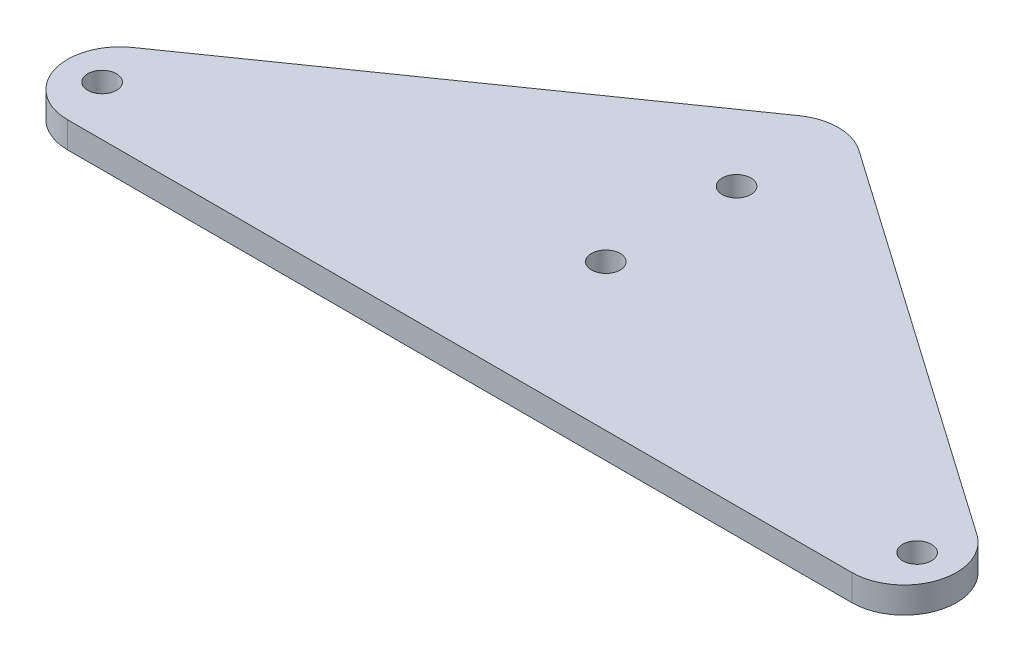
ISO-10303-21;
HEADER;
FILE_DESCRIPTION(('STEP AP214'),'2;1');
FILE_NAME('part.step','',(''),(''),'','','');
FILE_SCHEMA(('AUTOMOTIVE_DESIGN { 1 0 10303 214 1 1 1 1 }'));
ENDSEC;
DATA;
#1=APPLICATION_CONTEXT('core data for automotive mechanical design processes');
#2=APPLICATION_PROTOCOL_DEFINITION('international standard','automotive_design',2000,#1);
#3=PRODUCT_CONTEXT('',#1,'mechanical');
#4=PRODUCT('Part','Part','',(#3));
#5=PRODUCT_RELATED_PRODUCT_CATEGORY('part','',(#4));
#6=PRODUCT_DEFINITION_FORMATION('','',#4);
#7=PRODUCT_DEFINITION_CONTEXT('part definition',#1,'design');
#8=PRODUCT_DEFINITION('design','',#6,#7);
#9=PRODUCT_DEFINITION_SHAPE('','',#8);
#10=(LENGTH_UNIT() NAMED_UNIT(*) SI_UNIT(.MILLI.,.METRE.));
#11=(NAMED_UNIT(*) PLANE_ANGLE_UNIT() SI_UNIT($,.RADIAN.));
#12=(NAMED_UNIT(*) SI_UNIT($,.STERADIAN.) SOLID_ANGLE_UNIT());
#13=UNCERTAINTY_MEASURE_WITH_UNIT(LENGTH_MEASURE(1.E-05),#10,'distance_accuracy_value','');
#14=(GEOMETRIC_REPRESENTATION_CONTEXT(3) GLOBAL_UNCERTAINTY_ASSIGNED_CONTEXT((#13)) GLOBAL_UNIT_ASSIGNED_CONTEXT((#10,
#11,#12)) REPRESENTATION_CONTEXT('',''));
#15=CARTESIAN_POINT('',(0.,0.,0.));
#16=DIRECTION('',(0.,0.,1.));
#17=DIRECTION('',(1.,0.,0.));
#18=AXIS2_PLACEMENT_3D('',#15,#16,#17);
#19=CARTESIAN_POINT('',(75.,5.,-2.04927415816925));
#20=DIRECTION('',(0.,-1.,0.));
#21=DIRECTION('',(0.,0.,-1.));
#22=AXIS2_PLACEMENT_3D('',#19,#20,#21);
#23=CYLINDRICAL_SURFACE('',#22,10.);
#24=CARTESIAN_POINT('',(75.,0.,-2.04927415816925));
#25=DIRECTION('',(0.,1.,0.));
#26=DIRECTION('',(0.,0.,1.));
#27=AXIS2_PLACEMENT_3D('',#24,#25,#26);
#28=CIRCLE('',#27,10.);
#29=CARTESIAN_POINT('',(75.,0.,7.95072584183075));
#30=VERTEX_POINT('',#29);
#31=CARTESIAN_POINT('',(80.728613730277,0.,-10.2457968799874));
#32=VERTEX_POINT('',#31);
#33=EDGE_CURVE('E127',#30,#32,#28,.T.);
#34=ORIENTED_EDGE('',*,*,#33,.T.);
#35=DIRECTION('',(0.,-1.,0.));
#36=VECTOR('',#35,1.);
#37=CARTESIAN_POINT('',(80.728613730277,5.,-10.2457968799874));
#38=LINE('',#37,#36);
#39=CARTESIAN_POINT('',(80.728613730277,5.,-10.2457968799874));
#40=VERTEX_POINT('',#39);
#41=EDGE_CURVE('E11',#40,#32,#38,.T.);
#42=ORIENTED_EDGE('',*,*,#41,.F.);
#43=CARTESIAN_POINT('',(75.,5.,-2.04927415816925));
#44=DIRECTION('',(0.,1.,0.));
#45=DIRECTION('',(0.,0.,1.));
#46=AXIS2_PLACEMENT_3D('',#43,#44,#45);
#47=CIRCLE('',#46,10.);
#48=CARTESIAN_POINT('',(75.,5.,7.95072584183075));
#49=VERTEX_POINT('',#48);
#50=EDGE_CURVE('E138',#49,#40,#47,.T.);
#51=ORIENTED_EDGE('',*,*,#50,.F.);
#52=DIRECTION('',(0.,-1.,0.));
#53=VECTOR('',#52,1.);
#54=CARTESIAN_POINT('',(75.,5.,7.95072584183075));
#55=LINE('',#54,#53);
#56=EDGE_CURVE('E123',#49,#30,#55,.T.);
#57=ORIENTED_EDGE('',*,*,#56,.T.);
#58=EDGE_LOOP('',(#34,#42,#51,#57));
#59=FACE_BOUND('',#58,.T.);
#60=ADVANCED_FACE('F43',(#59),#23,.T.);
#61=CARTESIAN_POINT('',(80.728613730277,5.,-10.2457968799874));
#62=DIRECTION('',(-0.572861373027704,0.,0.819652272181816));
#63=DIRECTION('',(0.819652272181816,0.,0.572861373027704));
#64=AXIS2_PLACEMENT_3D('',#61,#62,#63);
#65=PLANE('',#64);
#66=DIRECTION('',(-0.819652272181816,0.,-0.572861373027704));
#67=VECTOR('',#66,1.);
#68=CARTESIAN_POINT('',(80.728613730277,0.,-10.2457968799874));
#69=LINE('',#68,#67);
#70=CARTESIAN_POINT('',(5.72861373027705,0.,-62.6638824941604));
#71=VERTEX_POINT('',#70);
#72=EDGE_CURVE('E130',#32,#71,#69,.T.);
#73=ORIENTED_EDGE('',*,*,#72,.T.);
#74=DIRECTION('',(0.,-1.,0.));
#75=VECTOR('',#74,1.);
#76=CARTESIAN_POINT('',(5.72861373027705,5.,-62.6638824941604));
#77=LINE('',#76,#75);
#78=CARTESIAN_POINT('',(5.72861373027705,5.,-62.6638824941604));
#79=VERTEX_POINT('',#78);
#80=EDGE_CURVE('E51',#79,#71,#77,.T.);
#81=ORIENTED_EDGE('',*,*,#80,.F.);
#82=DIRECTION('',(-0.819652272181816,0.,-0.572861373027704));
#83=VECTOR('',#82,1.);
#84=CARTESIAN_POINT('',(80.728613730277,5.,-10.2457968799874));
#85=LINE('',#84,#83);
#86=EDGE_CURVE('E96',#40,#79,#85,.T.);
#87=ORIENTED_EDGE('',*,*,#86,.F.);
#88=ORIENTED_EDGE('',*,*,#41,.T.);
#89=EDGE_LOOP('',(#73,#81,#87,#88));
#90=FACE_BOUND('',#89,.T.);
#91=ADVANCED_FACE('F163',(#90),#65,.F.);
#92=CARTESIAN_POINT('',(0.,5.,-54.4673597723422));
#93=DIRECTION('',(0.,-1.,0.));
#94=DIRECTION('',(0.,0.,-1.));
#95=AXIS2_PLACEMENT_3D('',#92,#93,#94);
#96=CYLINDRICAL_SURFACE('',#95,10.);
#97=CARTESIAN_POINT('',(0.,0.,-54.4673597723422));
#98=DIRECTION('',(0.,1.,0.));
#99=DIRECTION('',(0.,0.,-1.));
#100=AXIS2_PLACEMENT_3D('',#97,#98,#99);
#101=CIRCLE('',#100,10.);
#102=CARTESIAN_POINT('',(-5.72861373027705,0.,-62.6638824941604));
#103=VERTEX_POINT('',#102);
#104=EDGE_CURVE('E133',#71,#103,#101,.T.);
#105=ORIENTED_EDGE('',*,*,#104,.T.);
#106=DIRECTION('',(0.,-1.,0.));
#107=VECTOR('',#106,1.);
#108=CARTESIAN_POINT('',(-5.72861373027705,5.,-62.6638824941604));
#109=LINE('',#108,#107);
#110=CARTESIAN_POINT('',(-5.72861373027705,5.,-62.6638824941604));
#111=VERTEX_POINT('',#110);
#112=EDGE_CURVE('E118',#111,#103,#109,.T.);
#113=ORIENTED_EDGE('',*,*,#112,.F.);
#114=CARTESIAN_POINT('',(0.,5.,-54.4673597723422));
#115=DIRECTION('',(0.,1.,0.));
#116=DIRECTION('',(0.,0.,-1.));
#117=AXIS2_PLACEMENT_3D('',#114,#115,#116);
#118=CIRCLE('',#117,10.);
#119=EDGE_CURVE('E109',#79,#111,#118,.T.);
#120=ORIENTED_EDGE('',*,*,#119,.F.);
#121=ORIENTED_EDGE('',*,*,#80,.T.);
#122=EDGE_LOOP('',(#105,#113,#120,#121));
#123=FACE_BOUND('',#122,.T.);
#124=ADVANCED_FACE('F144',(#123),#96,.T.);
#125=CARTESIAN_POINT('',(-5.72861373027705,5.,-62.6638824941604));
#126=DIRECTION('',(0.572861373027704,0.,0.819652272181816));
#127=DIRECTION('',(0.819652272181816,0.,-0.572861373027704));
#128=AXIS2_PLACEMENT_3D('',#125,#126,#127);
#129=PLANE('',#128);
#130=DIRECTION('',(-0.819652272181816,0.,0.572861373027704));
#131=VECTOR('',#130,1.);
#132=CARTESIAN_POINT('',(-5.72861373027705,0.,-62.6638824941604));
#133=LINE('',#132,#131);
#134=CARTESIAN_POINT('',(-80.728613730277,0.,-10.2457968799874));
#135=VERTEX_POINT('',#134);
#136=EDGE_CURVE('E117',#103,#135,#133,.T.);
#137=ORIENTED_EDGE('',*,*,#136,.T.);
#138=DIRECTION('',(0.,-1.,0.));
#139=VECTOR('',#138,1.);
#140=CARTESIAN_POINT('',(-80.728613730277,5.,-10.2457968799874));
#141=LINE('',#140,#139);
#142=CARTESIAN_POINT('',(-80.728613730277,5.,-10.2457968799874));
#143=VERTEX_POINT('',#142);
#144=EDGE_CURVE('E114',#143,#135,#141,.T.);
#145=ORIENTED_EDGE('',*,*,#144,.F.);
#146=DIRECTION('',(-0.819652272181816,0.,0.572861373027704));
#147=VECTOR('',#146,1.);
#148=CARTESIAN_POINT('',(-5.72861373027705,5.,-62.6638824941604));
#149=LINE('',#148,#147);
#150=EDGE_CURVE('E103',#111,#143,#149,.T.);
#151=ORIENTED_EDGE('',*,*,#150,.F.);
#152=ORIENTED_EDGE('',*,*,#112,.T.);
#153=EDGE_LOOP('',(#137,#145,#151,#152));
#154=FACE_BOUND('',#153,.T.);
#155=ADVANCED_FACE('F115',(#154),#129,.F.);
#156=CARTESIAN_POINT('',(-75.,5.,-2.04927415816923));
#157=DIRECTION('',(0.,-1.,0.));
#158=DIRECTION('',(0.,0.,-1.));
#159=AXIS2_PLACEMENT_3D('',#156,#157,#158);
#160=CYLINDRICAL_SURFACE('',#159,10.);
#161=CARTESIAN_POINT('',(-75.,0.,-2.04927415816923));
#162=DIRECTION('',(0.,1.,0.));
#163=DIRECTION('',(0.,0.,1.));
#164=AXIS2_PLACEMENT_3D('',#161,#162,#163);
#165=CIRCLE('',#164,10.);
#166=CARTESIAN_POINT('',(-75.,0.,7.95072584183077));
#167=VERTEX_POINT('',#166);
#168=EDGE_CURVE('E82',#135,#167,#165,.T.);
#169=ORIENTED_EDGE('',*,*,#168,.T.);
#170=DIRECTION('',(0.,-1.,0.));
#171=VECTOR('',#170,1.);
#172=CARTESIAN_POINT('',(-75.,5.,7.95072584183077));
#173=LINE('',#172,#171);
#174=CARTESIAN_POINT('',(-75.,5.,7.95072584183077));
#175=VERTEX_POINT('',#174);
#176=EDGE_CURVE('E119',#175,#167,#173,.T.);
#177=ORIENTED_EDGE('',*,*,#176,.F.);
#178=CARTESIAN_POINT('',(-75.,5.,-2.04927415816923));
#179=DIRECTION('',(0.,1.,0.));
#180=DIRECTION('',(0.,0.,1.));
#181=AXIS2_PLACEMENT_3D('',#178,#179,#180);
#182=CIRCLE('',#181,10.);
#183=EDGE_CURVE('E107',#143,#175,#182,.T.);
#184=ORIENTED_EDGE('',*,*,#183,.F.);
#185=ORIENTED_EDGE('',*,*,#144,.T.);
#186=EDGE_LOOP('',(#169,#177,#184,#185));
#187=FACE_BOUND('',#186,.T.);
#188=ADVANCED_FACE('F121',(#187),#160,.T.);
#189=CARTESIAN_POINT('',(-75.,5.,7.95072584183077));
#190=DIRECTION('',(0.,0.,-1.));
#191=DIRECTION('',(-1.,0.,0.));
#192=AXIS2_PLACEMENT_3D('',#189,#190,#191);
#193=PLANE('',#192);
#194=DIRECTION('',(1.,0.,0.));
#195=VECTOR('',#194,1.);
#196=CARTESIAN_POINT('',(-75.,0.,7.95072584183077));
#197=LINE('',#196,#195);
#198=EDGE_CURVE('E88',#167,#30,#197,.T.);
#199=ORIENTED_EDGE('',*,*,#198,.T.);
#200=ORIENTED_EDGE('',*,*,#56,.F.);
#201=DIRECTION('',(1.,0.,0.));
#202=VECTOR('',#201,1.);
#203=CARTESIAN_POINT('',(-75.,5.,7.95072584183077));
#204=LINE('',#203,#202);
#205=EDGE_CURVE('E59',#175,#49,#204,.T.);
#206=ORIENTED_EDGE('',*,*,#205,.F.);
#207=ORIENTED_EDGE('',*,*,#176,.T.);
#208=EDGE_LOOP('',(#199,#200,#206,#207));
#209=FACE_BOUND('',#208,.T.);
#210=ADVANCED_FACE('F151',(#209),#193,.F.);
#211=CARTESIAN_POINT('',(75.,5.,-2.04927415816925));
#212=DIRECTION('',(0.,1.,0.));
#213=DIRECTION('',(0.,0.,1.));
#214=AXIS2_PLACEMENT_3D('',#211,#212,#213);
#215=PLANE('',#214);
#216=CARTESIAN_POINT('',(77.9289159969783,5.,-1.58750543105869));
#217=DIRECTION('',(0.,1.,0.));
#218=DIRECTION('',(0.,0.,1.));
#219=AXIS2_PLACEMENT_3D('',#216,#217,#218);
#220=CIRCLE('',#219,2.74999999999999);
#221=CARTESIAN_POINT('',(77.9289159969783,5.,1.1624945689413));
#222=VERTEX_POINT('',#221);
#223=EDGE_CURVE('E305',#222,#222,#220,.T.);
#224=ORIENTED_EDGE('',*,*,#223,.F.);
#225=EDGE_LOOP('',(#224));
#226=FACE_BOUND('',#225,.T.);
#227=CARTESIAN_POINT('',(-77.9289159969783,5.,-1.58750543105869));
#228=DIRECTION('',(0.,1.,0.));
#229=DIRECTION('',(0.,0.,1.));
#230=AXIS2_PLACEMENT_3D('',#227,#228,#229);
#231=CIRCLE('',#230,2.74999999999999);
#232=CARTESIAN_POINT('',(-77.9289159969783,5.,1.1624945689413));
#233=VERTEX_POINT('',#232);
#234=EDGE_CURVE('E307',#233,#233,#231,.T.);
#235=ORIENTED_EDGE('',*,*,#234,.F.);
#236=EDGE_LOOP('',(#235));
#237=FACE_BOUND('',#236,.T.);
#238=CARTESIAN_POINT('',(0.,5.,-45.));
#239=DIRECTION('',(0.,1.,0.));
#240=DIRECTION('',(0.,0.,1.));
#241=AXIS2_PLACEMENT_3D('',#238,#239,#240);
#242=CIRCLE('',#241,2.74999999999999);
#243=CARTESIAN_POINT('',(0.,5.,-42.25));
#244=VERTEX_POINT('',#243);
#245=EDGE_CURVE('E315',#244,#244,#242,.T.);
#246=ORIENTED_EDGE('',*,*,#245,.F.);
#247=EDGE_LOOP('',(#246));
#248=FACE_BOUND('',#247,.T.);
#249=CARTESIAN_POINT('',(0.,5.,-20.));
#250=DIRECTION('',(0.,1.,0.));
#251=DIRECTION('',(0.,0.,1.));
#252=AXIS2_PLACEMENT_3D('',#249,#250,#251);
#253=CIRCLE('',#252,2.74999999999999);
#254=CARTESIAN_POINT('',(0.,5.,-17.25));
#255=VERTEX_POINT('',#254);
#256=EDGE_CURVE('E321',#255,#255,#253,.T.);
#257=ORIENTED_EDGE('',*,*,#256,.F.);
#258=EDGE_LOOP('',(#257));
#259=FACE_BOUND('',#258,.T.);
#260=ORIENTED_EDGE('',*,*,#50,.T.);
#261=ORIENTED_EDGE('',*,*,#86,.T.);
#262=ORIENTED_EDGE('',*,*,#119,.T.);
#263=ORIENTED_EDGE('',*,*,#150,.T.);
#264=ORIENTED_EDGE('',*,*,#183,.T.);
#265=ORIENTED_EDGE('',*,*,#205,.T.);
#266=EDGE_LOOP('',(#260,#261,#262,#263,#264,#265));
#267=FACE_BOUND('',#266,.T.);
#268=ADVANCED_FACE('F105',(#226,#237,#248,#259,#267),#215,.T.);
#269=CARTESIAN_POINT('',(75.,0.,-2.04927415816925));
#270=DIRECTION('',(0.,1.,0.));
#271=DIRECTION('',(0.,0.,1.));
#272=AXIS2_PLACEMENT_3D('',#269,#270,#271);
#273=PLANE('',#272);
#274=CARTESIAN_POINT('',(77.9289159969783,0.,-1.58750543105869));
#275=DIRECTION('',(0.,1.,0.));
#276=DIRECTION('',(0.,0.,1.));
#277=AXIS2_PLACEMENT_3D('',#274,#275,#276);
#278=CIRCLE('',#277,2.75);
#279=CARTESIAN_POINT('',(77.9289159969783,0.,1.16249456894132));
#280=VERTEX_POINT('',#279);
#281=EDGE_CURVE('E302',#280,#280,#278,.T.);
#282=ORIENTED_EDGE('',*,*,#281,.T.);
#283=EDGE_LOOP('',(#282));
#284=FACE_BOUND('',#283,.T.);
#285=CARTESIAN_POINT('',(-77.9289159969783,0.,-1.58750543105869));
#286=DIRECTION('',(0.,1.,0.));
#287=DIRECTION('',(0.,0.,1.));
#288=AXIS2_PLACEMENT_3D('',#285,#286,#287);
#289=CIRCLE('',#288,2.75);
#290=CARTESIAN_POINT('',(-77.9289159969783,0.,1.16249456894132));
#291=VERTEX_POINT('',#290);
#292=EDGE_CURVE('E312',#291,#291,#289,.T.);
#293=ORIENTED_EDGE('',*,*,#292,.T.);
#294=EDGE_LOOP('',(#293));
#295=FACE_BOUND('',#294,.T.);
#296=CARTESIAN_POINT('',(0.,0.,-45.));
#297=DIRECTION('',(0.,1.,0.));
#298=DIRECTION('',(0.,0.,1.));
#299=AXIS2_PLACEMENT_3D('',#296,#297,#298);
#300=CIRCLE('',#299,2.75);
#301=CARTESIAN_POINT('',(0.,0.,-42.25));
#302=VERTEX_POINT('',#301);
#303=EDGE_CURVE('E318',#302,#302,#300,.T.);
#304=ORIENTED_EDGE('',*,*,#303,.T.);
#305=EDGE_LOOP('',(#304));
#306=FACE_BOUND('',#305,.T.);
#307=CARTESIAN_POINT('',(0.,0.,-20.));
#308=DIRECTION('',(0.,1.,0.));
#309=DIRECTION('',(0.,0.,1.));
#310=AXIS2_PLACEMENT_3D('',#307,#308,#309);
#311=CIRCLE('',#310,2.75);
#312=CARTESIAN_POINT('',(0.,0.,-17.25));
#313=VERTEX_POINT('',#312);
#314=EDGE_CURVE('E131',#313,#313,#311,.T.);
#315=ORIENTED_EDGE('',*,*,#314,.T.);
#316=EDGE_LOOP('',(#315));
#317=FACE_BOUND('',#316,.T.);
#318=ORIENTED_EDGE('',*,*,#33,.F.);
#319=ORIENTED_EDGE('',*,*,#198,.F.);
#320=ORIENTED_EDGE('',*,*,#168,.F.);
#321=ORIENTED_EDGE('',*,*,#136,.F.);
#322=ORIENTED_EDGE('',*,*,#104,.F.);
#323=ORIENTED_EDGE('',*,*,#72,.F.);
#324=EDGE_LOOP('',(#318,#319,#320,#321,#322,#323));
#325=FACE_BOUND('',#324,.T.);
#326=ADVANCED_FACE('F147',(#284,#295,#306,#317,#325),#273,.F.);
#327=CARTESIAN_POINT('',(0.,5.,-20.));
#328=DIRECTION('',(0.,1.,0.));
#329=DIRECTION('',(0.,0.,1.));
#330=AXIS2_PLACEMENT_3D('',#327,#328,#329);
#331=CYLINDRICAL_SURFACE('',#330,2.74999999999999);
#332=ORIENTED_EDGE('',*,*,#314,.F.);
#333=EDGE_LOOP('',(#332));
#334=FACE_BOUND('',#333,.T.);
#335=ORIENTED_EDGE('',*,*,#256,.T.);
#336=EDGE_LOOP('',(#335));
#337=FACE_BOUND('',#336,.T.);
#338=ADVANCED_FACE('F193',(#334,#337),#331,.F.);
#339=CARTESIAN_POINT('',(0.,5.,-45.));
#340=DIRECTION('',(0.,1.,0.));
#341=DIRECTION('',(0.,0.,1.));
#342=AXIS2_PLACEMENT_3D('',#339,#340,#341);
#343=CYLINDRICAL_SURFACE('',#342,2.74999999999999);
#344=ORIENTED_EDGE('',*,*,#303,.F.);
#345=EDGE_LOOP('',(#344));
#346=FACE_BOUND('',#345,.T.);
#347=ORIENTED_EDGE('',*,*,#245,.T.);
#348=EDGE_LOOP('',(#347));
#349=FACE_BOUND('',#348,.T.);
#350=ADVANCED_FACE('F198',(#346,#349),#343,.F.);
#351=CARTESIAN_POINT('',(-77.9289159969783,5.,-1.58750543105869));
#352=DIRECTION('',(0.,1.,0.));
#353=DIRECTION('',(0.,0.,1.));
#354=AXIS2_PLACEMENT_3D('',#351,#352,#353);
#355=CYLINDRICAL_SURFACE('',#354,2.75);
#356=ORIENTED_EDGE('',*,*,#292,.F.);
#357=EDGE_LOOP('',(#356));
#358=FACE_BOUND('',#357,.T.);
#359=ORIENTED_EDGE('',*,*,#234,.T.);
#360=EDGE_LOOP('',(#359));
#361=FACE_BOUND('',#360,.T.);
#362=ADVANCED_FACE('F211',(#358,#361),#355,.F.);
#363=CARTESIAN_POINT('',(77.9289159969783,5.,-1.58750543105869));
#364=DIRECTION('',(0.,1.,0.));
#365=DIRECTION('',(0.,0.,1.));
#366=AXIS2_PLACEMENT_3D('',#363,#364,#365);
#367=CYLINDRICAL_SURFACE('',#366,2.75);
#368=ORIENTED_EDGE('',*,*,#281,.F.);
#369=EDGE_LOOP('',(#368));
#370=FACE_BOUND('',#369,.T.);
#371=ORIENTED_EDGE('',*,*,#223,.T.);
#372=EDGE_LOOP('',(#371));
#373=FACE_BOUND('',#372,.T.);
#374=ADVANCED_FACE('F222',(#370,#373),#367,.F.);
#375=CLOSED_SHELL('',(#60,#91,#124,#155,#188,#210,#268,#326,#338,#350,#362,#374));
#376=MANIFOLD_SOLID_BREP('B2',#375);
#377=ADVANCED_BREP_SHAPE_REPRESENTATION('',(#18,#376),#14);
#378=SHAPE_DEFINITION_REPRESENTATION(#9,#377);
ENDSEC;
END-ISO-10303-21;
